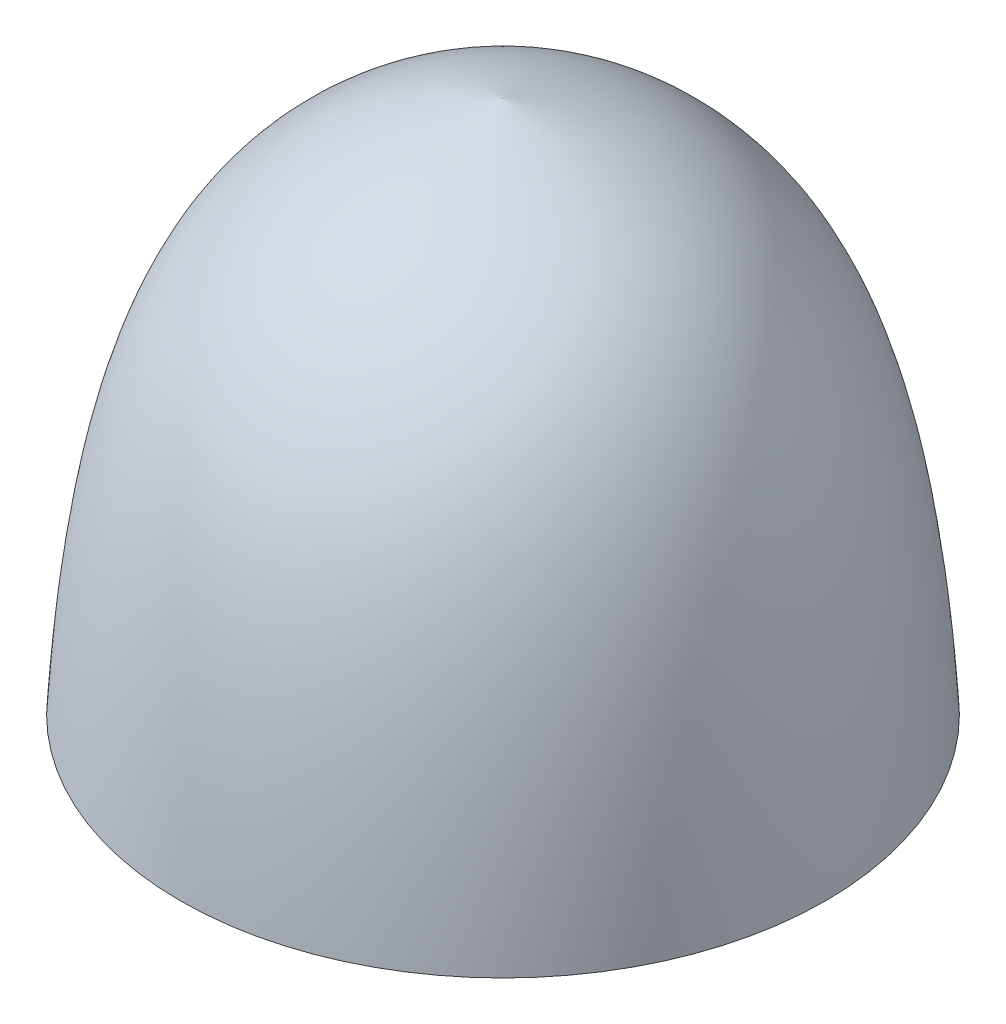
ISO-10303-21;
HEADER;
FILE_DESCRIPTION(('STEP AP214'),'2;1');
FILE_NAME('part.step','',(''),(''),'','','');
FILE_SCHEMA(('AUTOMOTIVE_DESIGN { 1 0 10303 214 1 1 1 1 }'));
ENDSEC;
DATA;
#1=APPLICATION_CONTEXT('core data for automotive mechanical design processes');
#2=APPLICATION_PROTOCOL_DEFINITION('international standard','automotive_design',2000,#1);
#3=PRODUCT_CONTEXT('',#1,'mechanical');
#4=PRODUCT('Part','Part','',(#3));
#5=PRODUCT_RELATED_PRODUCT_CATEGORY('part','',(#4));
#6=PRODUCT_DEFINITION_FORMATION('','',#4);
#7=PRODUCT_DEFINITION_CONTEXT('part definition',#1,'design');
#8=PRODUCT_DEFINITION('design','',#6,#7);
#9=PRODUCT_DEFINITION_SHAPE('','',#8);
#10=(LENGTH_UNIT() NAMED_UNIT(*) SI_UNIT(.MILLI.,.METRE.));
#11=(NAMED_UNIT(*) PLANE_ANGLE_UNIT() SI_UNIT($,.RADIAN.));
#12=(NAMED_UNIT(*) SI_UNIT($,.STERADIAN.) SOLID_ANGLE_UNIT());
#13=UNCERTAINTY_MEASURE_WITH_UNIT(LENGTH_MEASURE(1.E-05),#10,'distance_accuracy_value','');
#14=(GEOMETRIC_REPRESENTATION_CONTEXT(3) GLOBAL_UNCERTAINTY_ASSIGNED_CONTEXT((#13)) GLOBAL_UNIT_ASSIGNED_CONTEXT((#10,
#11,#12)) REPRESENTATION_CONTEXT('',''));
#15=CARTESIAN_POINT('',(0.,0.,0.));
#16=DIRECTION('',(0.,0.,1.));
#17=DIRECTION('',(1.,0.,0.));
#18=AXIS2_PLACEMENT_3D('',#15,#16,#17);
#19=CARTESIAN_POINT('',(17.6797511338382,0.,0.));
#20=CARTESIAN_POINT('',(16.4856250095626,19.4434589861659,0.));
#21=CARTESIAN_POINT('',(12.1252049669716,26.4923820403787,0.));
#22=CARTESIAN_POINT('',(0.,29.2129749863642,0.));
#23=B_SPLINE_CURVE_WITH_KNOTS('',3,(#19,#20,#21,#22),.UNSPECIFIED.,.F.,.F.,(4,4),(0.,1.),.UNSPECIFIED.);
#24=CARTESIAN_POINT('',(0.,0.,0.));
#25=DIRECTION('',(0.,-1.,0.));
#26=AXIS1_PLACEMENT('',#24,#25);
#27=SURFACE_OF_REVOLUTION('',#23,#26);
#28=CARTESIAN_POINT('',(0.,29.2129749863642,0.));
#29=VERTEX_POINT('',#28);
#30=VERTEX_LOOP('',#29);
#31=FACE_BOUND('',#30,.T.);
#32=CARTESIAN_POINT('',(0.,0.,0.));
#33=DIRECTION('',(0.,-1.,0.));
#34=DIRECTION('',(0.,0.,-1.));
#35=AXIS2_PLACEMENT_3D('',#32,#33,#34);
#36=CIRCLE('',#35,17.6797511338382);
#37=CARTESIAN_POINT('',(0.,0.,-17.6797511338382));
#38=VERTEX_POINT('',#37);
#39=EDGE_CURVE('E11',#38,#38,#36,.T.);
#40=ORIENTED_EDGE('',*,*,#39,.F.);
#41=EDGE_LOOP('',(#40));
#42=FACE_BOUND('',#41,.T.);
#43=ADVANCED_FACE('F32',(#31,#42),#27,.F.);
#44=CARTESIAN_POINT('',(12.7,0.,0.));
#45=DIRECTION('',(0.,-1.,0.));
#46=DIRECTION('',(0.,0.,-1.));
#47=AXIS2_PLACEMENT_3D('',#44,#45,#46);
#48=PLANE('',#47);
#49=CARTESIAN_POINT('',(0.,0.,0.));
#50=DIRECTION('',(0.,-1.,0.));
#51=DIRECTION('',(0.,0.,-1.));
#52=AXIS2_PLACEMENT_3D('',#49,#50,#51);
#53=CIRCLE('',#52,12.7);
#54=CARTESIAN_POINT('',(0.,0.,-12.7));
#55=VERTEX_POINT('',#54);
#56=EDGE_CURVE('E63',#55,#55,#53,.T.);
#57=ORIENTED_EDGE('',*,*,#56,.F.);
#58=EDGE_LOOP('',(#57));
#59=FACE_BOUND('',#58,.T.);
#60=ORIENTED_EDGE('',*,*,#39,.T.);
#61=EDGE_LOOP('',(#60));
#62=FACE_BOUND('',#61,.T.);
#63=ADVANCED_FACE('F43',(#59,#62),#48,.T.);
#64=CARTESIAN_POINT('',(0.,19.05,0.));
#65=DIRECTION('',(0.,-1.,0.));
#66=DIRECTION('',(0.,0.,-1.));
#67=AXIS2_PLACEMENT_3D('',#64,#65,#66);
#68=CYLINDRICAL_SURFACE('',#67,12.7);
#69=CARTESIAN_POINT('',(0.,19.05,0.));
#70=DIRECTION('',(0.,-1.,0.));
#71=DIRECTION('',(0.,0.,-1.));
#72=AXIS2_PLACEMENT_3D('',#69,#70,#71);
#73=CIRCLE('',#72,12.7);
#74=CARTESIAN_POINT('',(0.,19.05,-12.7));
#75=VERTEX_POINT('',#74);
#76=EDGE_CURVE('E38',#75,#75,#73,.T.);
#77=ORIENTED_EDGE('',*,*,#76,.F.);
#78=EDGE_LOOP('',(#77));
#79=FACE_BOUND('',#78,.T.);
#80=ORIENTED_EDGE('',*,*,#56,.T.);
#81=EDGE_LOOP('',(#80));
#82=FACE_BOUND('',#81,.T.);
#83=ADVANCED_FACE('F47',(#79,#82),#68,.F.);
#84=CARTESIAN_POINT('',(0.,19.05,0.));
#85=DIRECTION('',(0.,-1.,0.));
#86=DIRECTION('',(0.,0.,-1.));
#87=AXIS2_PLACEMENT_3D('',#84,#85,#86);
#88=PLANE('',#87);
#89=ORIENTED_EDGE('',*,*,#76,.T.);
#90=EDGE_LOOP('',(#89));
#91=FACE_BOUND('',#90,.T.);
#92=ADVANCED_FACE('F52',(#91),#88,.T.);
#93=CLOSED_SHELL('',(#43,#63,#83,#92));
#94=MANIFOLD_SOLID_BREP('B2',#93);
#95=ADVANCED_BREP_SHAPE_REPRESENTATION('',(#18,#94),#14);
#96=SHAPE_DEFINITION_REPRESENTATION(#9,#95);
ENDSEC;
END-ISO-10303-21;
